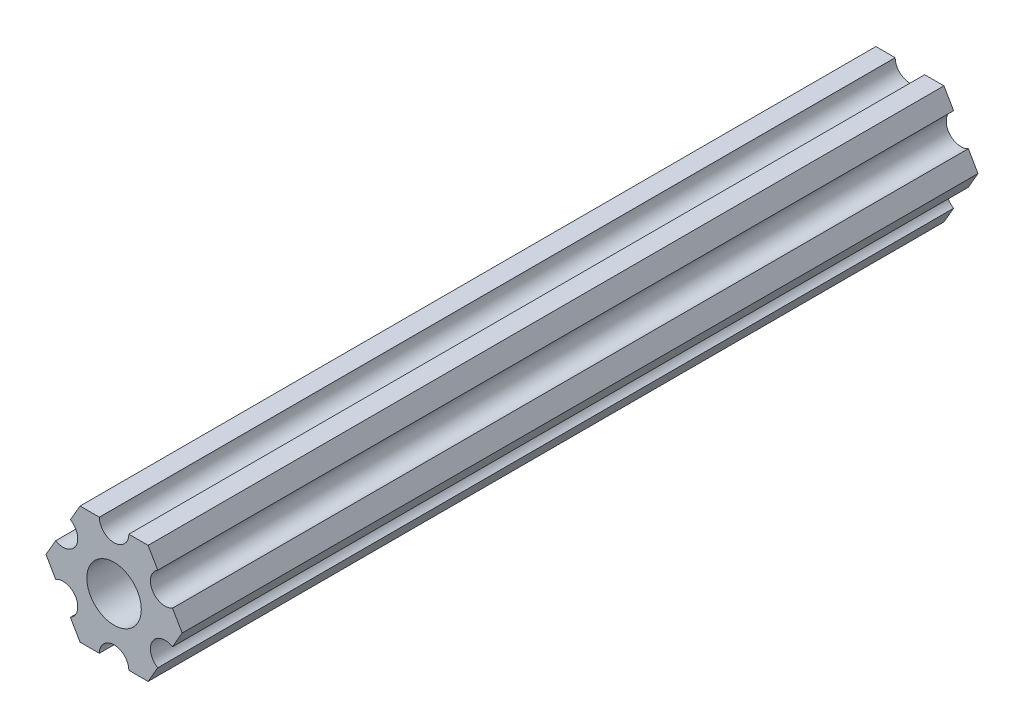
ISO-10303-21;
HEADER;
FILE_DESCRIPTION(('STEP AP214'),'2;1');
FILE_NAME('part.step','',(''),(''),'','','');
FILE_SCHEMA(('AUTOMOTIVE_DESIGN { 1 0 10303 214 1 1 1 1 }'));
ENDSEC;
DATA;
#1=APPLICATION_CONTEXT('core data for automotive mechanical design processes');
#2=APPLICATION_PROTOCOL_DEFINITION('international standard','automotive_design',2000,#1);
#3=PRODUCT_CONTEXT('',#1,'mechanical');
#4=PRODUCT('Part','Part','',(#3));
#5=PRODUCT_RELATED_PRODUCT_CATEGORY('part','',(#4));
#6=PRODUCT_DEFINITION_FORMATION('','',#4);
#7=PRODUCT_DEFINITION_CONTEXT('part definition',#1,'design');
#8=PRODUCT_DEFINITION('design','',#6,#7);
#9=PRODUCT_DEFINITION_SHAPE('','',#8);
#10=(LENGTH_UNIT() NAMED_UNIT(*) SI_UNIT(.MILLI.,.METRE.));
#11=(NAMED_UNIT(*) PLANE_ANGLE_UNIT() SI_UNIT($,.RADIAN.));
#12=(NAMED_UNIT(*) SI_UNIT($,.STERADIAN.) SOLID_ANGLE_UNIT());
#13=UNCERTAINTY_MEASURE_WITH_UNIT(LENGTH_MEASURE(1.E-05),#10,'distance_accuracy_value','');
#14=(GEOMETRIC_REPRESENTATION_CONTEXT(3) GLOBAL_UNCERTAINTY_ASSIGNED_CONTEXT((#13)) GLOBAL_UNIT_ASSIGNED_CONTEXT((#10,
#11,#12)) REPRESENTATION_CONTEXT('',''));
#15=CARTESIAN_POINT('',(0.,0.,0.));
#16=DIRECTION('',(0.,0.,1.));
#17=DIRECTION('',(1.,0.,0.));
#18=AXIS2_PLACEMENT_3D('',#15,#16,#17);
#19=CARTESIAN_POINT('',(5.49926112168156,3.17500033315933,85.725));
#20=DIRECTION('',(0.,0.,1.));
#21=DIRECTION('',(1.,0.,0.));
#22=AXIS2_PLACEMENT_3D('',#19,#20,#21);
#23=PLANE('',#22);
#24=DIRECTION('',(0.499999947533953,0.866025434075723,0.));
#25=VECTOR('',#24,1.);
#26=CARTESIAN_POINT('',(6.29301142309098,-1.80018429024546,85.725));
#27=LINE('',#26,#25);
#28=CARTESIAN_POINT('',(6.29301142309098,-1.80018429024546,85.725));
#29=VERTEX_POINT('',#28);
#30=CARTESIAN_POINT('',(7.33234841870826,4.44212519169686E-07,85.725));
#31=VERTEX_POINT('',#30);
#32=EDGE_CURVE('E228',#29,#31,#27,.T.);
#33=ORIENTED_EDGE('',*,*,#32,.T.);
#34=DIRECTION('',(-0.500000052466056,0.866025373493145,0.));
#35=VECTOR('',#34,1.);
#36=CARTESIAN_POINT('',(7.33234841870826,4.44212519169686E-07,85.725));
#37=LINE('',#36,#35);
#38=CARTESIAN_POINT('',(6.29301120497139,1.80018505273894,85.725));
#39=VERTEX_POINT('',#38);
#40=EDGE_CURVE('E126',#31,#39,#37,.T.);
#41=ORIENTED_EDGE('',*,*,#40,.T.);
#42=CARTESIAN_POINT('',(5.49926112168156,3.17500033315933,85.725));
#43=DIRECTION('',(0.,0.,-1.));
#44=DIRECTION('',(1.,0.,0.));
#45=AXIS2_PLACEMENT_3D('',#42,#43,#44);
#46=CIRCLE('',#45,1.5875);
#47=CARTESIAN_POINT('',(4.70551103839172,4.54981561357972,85.725));
#48=VERTEX_POINT('',#47);
#49=EDGE_CURVE('E273',#39,#48,#46,.T.);
#50=ORIENTED_EDGE('',*,*,#49,.T.);
#51=DIRECTION('',(-0.500000052466046,0.866025373493151,0.));
#52=VECTOR('',#51,1.);
#53=CARTESIAN_POINT('',(4.70551103839172,4.54981561357972,85.725));
#54=LINE('',#53,#52);
#55=CARTESIAN_POINT('',(3.66617382465481,6.35000022210627,85.725));
#56=VERTEX_POINT('',#55);
#57=EDGE_CURVE('E292',#48,#56,#54,.T.);
#58=ORIENTED_EDGE('',*,*,#57,.T.);
#59=DIRECTION('',(-0.999999999999998,-6.05825850611185E-08,0.));
#60=VECTOR('',#59,1.);
#61=CARTESIAN_POINT('',(3.66617382465481,6.35000022210627,85.725));
#62=LINE('',#61,#60);
#63=CARTESIAN_POINT('',(1.58749961530074,6.35000009617482,85.725));
#64=VERTEX_POINT('',#63);
#65=EDGE_CURVE('E289',#56,#64,#62,.T.);
#66=ORIENTED_EDGE('',*,*,#65,.T.);
#67=CARTESIAN_POINT('',(-3.84699260060323E-07,6.35,85.725));
#68=DIRECTION('',(0.,0.,-1.));
#69=DIRECTION('',(1.,0.,0.));
#70=AXIS2_PLACEMENT_3D('',#67,#68,#69);
#71=CIRCLE('',#70,1.5875);
#72=CARTESIAN_POINT('',(-1.58750038469926,6.34999990382518,85.725));
#73=VERTEX_POINT('',#72);
#74=EDGE_CURVE('E291',#64,#73,#71,.T.);
#75=ORIENTED_EDGE('',*,*,#74,.T.);
#76=DIRECTION('',(-0.999999999999998,-6.05825963273174E-08,0.));
#77=VECTOR('',#76,1.);
#78=CARTESIAN_POINT('',(-1.58750038469926,6.34999990382518,85.725));
#79=LINE('',#78,#77);
#80=CARTESIAN_POINT('',(-3.66617459405349,6.3499997778937,85.725));
#81=VERTEX_POINT('',#80);
#82=EDGE_CURVE('E294',#73,#81,#79,.T.);
#83=ORIENTED_EDGE('',*,*,#82,.T.);
#84=DIRECTION('',(-0.499999947533942,-0.866025434075729,0.));
#85=VECTOR('',#84,1.);
#86=CARTESIAN_POINT('',(-3.66617459405349,6.3499997778937,85.725));
#87=LINE('',#86,#85);
#88=CARTESIAN_POINT('',(-4.70551158967065,4.54981504343587,85.725));
#89=VERTEX_POINT('',#88);
#90=EDGE_CURVE('E300',#81,#89,#87,.T.);
#91=ORIENTED_EDGE('',*,*,#90,.T.);
#92=CARTESIAN_POINT('',(-5.49926150638082,3.17499966684067,85.725));
#93=DIRECTION('',(0.,0.,-1.));
#94=DIRECTION('',(1.,0.,0.));
#95=AXIS2_PLACEMENT_3D('',#92,#93,#94);
#96=CIRCLE('',#95,1.5875);
#97=CARTESIAN_POINT('',(-6.29301142309098,1.80018429024547,85.725));
#98=VERTEX_POINT('',#97);
#99=EDGE_CURVE('E302',#89,#98,#96,.T.);
#100=ORIENTED_EDGE('',*,*,#99,.T.);
#101=DIRECTION('',(-0.499999947533951,-0.866025434075724,0.));
#102=VECTOR('',#101,1.);
#103=CARTESIAN_POINT('',(-6.29301142309098,1.80018429024547,85.725));
#104=LINE('',#103,#102);
#105=CARTESIAN_POINT('',(-7.33234841870826,-4.44212523790841E-07,85.725));
#106=VERTEX_POINT('',#105);
#107=EDGE_CURVE('E304',#98,#106,#104,.T.);
#108=ORIENTED_EDGE('',*,*,#107,.T.);
#109=DIRECTION('',(0.500000052466045,-0.866025373493151,0.));
#110=VECTOR('',#109,1.);
#111=CARTESIAN_POINT('',(-7.33234841870826,-4.44212523790841E-07,85.725));
#112=LINE('',#111,#110);
#113=CARTESIAN_POINT('',(-6.29301120497141,-1.80018505273897,85.725));
#114=VERTEX_POINT('',#113);
#115=EDGE_CURVE('E306',#106,#114,#112,.T.);
#116=ORIENTED_EDGE('',*,*,#115,.T.);
#117=CARTESIAN_POINT('',(-5.49926112168156,-3.17500033315934,85.725));
#118=DIRECTION('',(0.,0.,-1.));
#119=DIRECTION('',(1.,0.,0.));
#120=AXIS2_PLACEMENT_3D('',#117,#118,#119);
#121=CIRCLE('',#120,1.5875);
#122=CARTESIAN_POINT('',(-4.70551103839172,-4.54981561357972,85.725));
#123=VERTEX_POINT('',#122);
#124=EDGE_CURVE('E308',#114,#123,#121,.T.);
#125=ORIENTED_EDGE('',*,*,#124,.T.);
#126=DIRECTION('',(0.500000052466045,-0.866025373493151,0.));
#127=VECTOR('',#126,1.);
#128=CARTESIAN_POINT('',(-4.70551103839172,-4.54981561357972,85.725));
#129=LINE('',#128,#127);
#130=CARTESIAN_POINT('',(-3.66617382465481,-6.35000022210628,85.725));
#131=VERTEX_POINT('',#130);
#132=EDGE_CURVE('E310',#123,#131,#129,.T.);
#133=ORIENTED_EDGE('',*,*,#132,.T.);
#134=DIRECTION('',(0.999999999999998,6.05825854783851E-08,0.));
#135=VECTOR('',#134,1.);
#136=CARTESIAN_POINT('',(-3.66617382465481,-6.35000022210628,85.725));
#137=LINE('',#136,#135);
#138=CARTESIAN_POINT('',(-1.58749961530074,-6.35000009617482,85.725));
#139=VERTEX_POINT('',#138);
#140=EDGE_CURVE('E312',#131,#139,#137,.T.);
#141=ORIENTED_EDGE('',*,*,#140,.T.);
#142=CARTESIAN_POINT('',(3.8469926204343E-07,-6.35,85.725));
#143=DIRECTION('',(0.,0.,-1.));
#144=DIRECTION('',(1.,0.,0.));
#145=AXIS2_PLACEMENT_3D('',#142,#143,#144);
#146=CIRCLE('',#145,1.5875);
#147=CARTESIAN_POINT('',(1.58750038469926,-6.34999990382518,85.725));
#148=VERTEX_POINT('',#147);
#149=EDGE_CURVE('E175',#139,#148,#146,.T.);
#150=ORIENTED_EDGE('',*,*,#149,.T.);
#151=DIRECTION('',(0.999999999999998,6.05825721258438E-08,0.));
#152=VECTOR('',#151,1.);
#153=CARTESIAN_POINT('',(1.58750038469926,-6.34999990382518,85.725));
#154=LINE('',#153,#152);
#155=CARTESIAN_POINT('',(3.66617459405346,-6.34999977789375,85.725));
#156=VERTEX_POINT('',#155);
#157=EDGE_CURVE('E169',#148,#156,#154,.T.);
#158=ORIENTED_EDGE('',*,*,#157,.T.);
#159=DIRECTION('',(0.499999947533941,0.86602543407573,0.));
#160=VECTOR('',#159,1.);
#161=CARTESIAN_POINT('',(3.66617459405346,-6.34999977789375,85.725));
#162=LINE('',#161,#160);
#163=CARTESIAN_POINT('',(4.70551158967065,-4.54981504343587,85.725));
#164=VERTEX_POINT('',#163);
#165=EDGE_CURVE('E173',#156,#164,#162,.T.);
#166=ORIENTED_EDGE('',*,*,#165,.T.);
#167=CARTESIAN_POINT('',(5.49926150638082,-3.17499966684067,85.725));
#168=DIRECTION('',(0.,0.,-1.));
#169=DIRECTION('',(1.,0.,0.));
#170=AXIS2_PLACEMENT_3D('',#167,#168,#169);
#171=CIRCLE('',#170,1.58750000000001);
#172=EDGE_CURVE('E53',#164,#29,#171,.T.);
#173=ORIENTED_EDGE('',*,*,#172,.T.);
#174=EDGE_LOOP('',(#33,#41,#50,#58,#66,#75,#83,#91,#100,#108,#116,#125,#133,#141,#150,#158,#166,#173));
#175=FACE_BOUND('',#174,.T.);
#176=CARTESIAN_POINT('',(0.,0.,85.725));
#177=DIRECTION('',(0.,0.,1.));
#178=DIRECTION('',(1.,0.,0.));
#179=AXIS2_PLACEMENT_3D('',#176,#177,#178);
#180=CIRCLE('',#179,2.9337);
#181=CARTESIAN_POINT('',(2.9337,0.,85.725));
#182=VERTEX_POINT('',#181);
#183=EDGE_CURVE('E197',#182,#182,#180,.T.);
#184=ORIENTED_EDGE('',*,*,#183,.F.);
#185=EDGE_LOOP('',(#184));
#186=FACE_BOUND('',#185,.T.);
#187=ADVANCED_FACE('F36',(#175,#186),#23,.T.);
#188=CARTESIAN_POINT('',(5.49926112168156,3.17500033315933,0.));
#189=DIRECTION('',(0.,0.,1.));
#190=DIRECTION('',(1.,0.,0.));
#191=AXIS2_PLACEMENT_3D('',#188,#189,#190);
#192=PLANE('',#191);
#193=DIRECTION('',(0.499999947533953,0.866025434075723,0.));
#194=VECTOR('',#193,1.);
#195=CARTESIAN_POINT('',(6.29301142309098,-1.80018429024546,0.));
#196=LINE('',#195,#194);
#197=CARTESIAN_POINT('',(6.29301142309098,-1.80018429024546,0.));
#198=VERTEX_POINT('',#197);
#199=CARTESIAN_POINT('',(7.33234841870826,4.44212519169686E-07,0.));
#200=VERTEX_POINT('',#199);
#201=EDGE_CURVE('E193',#198,#200,#196,.T.);
#202=ORIENTED_EDGE('',*,*,#201,.F.);
#203=CARTESIAN_POINT('',(5.49926150638082,-3.17499966684067,0.));
#204=DIRECTION('',(0.,0.,-1.));
#205=DIRECTION('',(1.,0.,0.));
#206=AXIS2_PLACEMENT_3D('',#203,#204,#205);
#207=CIRCLE('',#206,1.58750000000001);
#208=CARTESIAN_POINT('',(4.70551158967065,-4.54981504343587,0.));
#209=VERTEX_POINT('',#208);
#210=EDGE_CURVE('E118',#209,#198,#207,.T.);
#211=ORIENTED_EDGE('',*,*,#210,.F.);
#212=DIRECTION('',(0.499999947533941,0.86602543407573,0.));
#213=VECTOR('',#212,1.);
#214=CARTESIAN_POINT('',(3.66617459405346,-6.34999977789375,0.));
#215=LINE('',#214,#213);
#216=CARTESIAN_POINT('',(3.66617459405346,-6.34999977789375,0.));
#217=VERTEX_POINT('',#216);
#218=EDGE_CURVE('E112',#217,#209,#215,.T.);
#219=ORIENTED_EDGE('',*,*,#218,.F.);
#220=DIRECTION('',(0.999999999999998,6.05825721258438E-08,0.));
#221=VECTOR('',#220,1.);
#222=CARTESIAN_POINT('',(1.58750038469926,-6.34999990382518,0.));
#223=LINE('',#222,#221);
#224=CARTESIAN_POINT('',(1.58750038469926,-6.34999990382518,0.));
#225=VERTEX_POINT('',#224);
#226=EDGE_CURVE('E183',#225,#217,#223,.T.);
#227=ORIENTED_EDGE('',*,*,#226,.F.);
#228=CARTESIAN_POINT('',(3.8469926204343E-07,-6.35,0.));
#229=DIRECTION('',(0.,0.,-1.));
#230=DIRECTION('',(1.,0.,0.));
#231=AXIS2_PLACEMENT_3D('',#228,#229,#230);
#232=CIRCLE('',#231,1.5875);
#233=CARTESIAN_POINT('',(-1.58749961530074,-6.35000009617482,0.));
#234=VERTEX_POINT('',#233);
#235=EDGE_CURVE('E223',#234,#225,#232,.T.);
#236=ORIENTED_EDGE('',*,*,#235,.F.);
#237=DIRECTION('',(0.999999999999998,6.05825854783851E-08,0.));
#238=VECTOR('',#237,1.);
#239=CARTESIAN_POINT('',(-3.66617382465481,-6.35000022210628,0.));
#240=LINE('',#239,#238);
#241=CARTESIAN_POINT('',(-3.66617382465481,-6.35000022210628,0.));
#242=VERTEX_POINT('',#241);
#243=EDGE_CURVE('E221',#242,#234,#240,.T.);
#244=ORIENTED_EDGE('',*,*,#243,.F.);
#245=DIRECTION('',(0.500000052466045,-0.866025373493151,0.));
#246=VECTOR('',#245,1.);
#247=CARTESIAN_POINT('',(-4.70551103839172,-4.54981561357972,0.));
#248=LINE('',#247,#246);
#249=CARTESIAN_POINT('',(-4.70551103839172,-4.54981561357972,0.));
#250=VERTEX_POINT('',#249);
#251=EDGE_CURVE('E219',#250,#242,#248,.T.);
#252=ORIENTED_EDGE('',*,*,#251,.F.);
#253=CARTESIAN_POINT('',(-5.49926112168156,-3.17500033315934,0.));
#254=DIRECTION('',(0.,0.,-1.));
#255=DIRECTION('',(1.,0.,0.));
#256=AXIS2_PLACEMENT_3D('',#253,#254,#255);
#257=CIRCLE('',#256,1.5875);
#258=CARTESIAN_POINT('',(-6.29301120497141,-1.80018505273897,0.));
#259=VERTEX_POINT('',#258);
#260=EDGE_CURVE('E217',#259,#250,#257,.T.);
#261=ORIENTED_EDGE('',*,*,#260,.F.);
#262=DIRECTION('',(0.500000052466045,-0.866025373493151,0.));
#263=VECTOR('',#262,1.);
#264=CARTESIAN_POINT('',(-7.33234841870826,-4.44212523790841E-07,0.));
#265=LINE('',#264,#263);
#266=CARTESIAN_POINT('',(-7.33234841870826,-4.44212523790841E-07,0.));
#267=VERTEX_POINT('',#266);
#268=EDGE_CURVE('E215',#267,#259,#265,.T.);
#269=ORIENTED_EDGE('',*,*,#268,.F.);
#270=DIRECTION('',(-0.499999947533951,-0.866025434075724,0.));
#271=VECTOR('',#270,1.);
#272=CARTESIAN_POINT('',(-6.29301142309098,1.80018429024547,0.));
#273=LINE('',#272,#271);
#274=CARTESIAN_POINT('',(-6.29301142309098,1.80018429024547,0.));
#275=VERTEX_POINT('',#274);
#276=EDGE_CURVE('E213',#275,#267,#273,.T.);
#277=ORIENTED_EDGE('',*,*,#276,.F.);
#278=CARTESIAN_POINT('',(-5.49926150638082,3.17499966684067,0.));
#279=DIRECTION('',(0.,0.,-1.));
#280=DIRECTION('',(1.,0.,0.));
#281=AXIS2_PLACEMENT_3D('',#278,#279,#280);
#282=CIRCLE('',#281,1.5875);
#283=CARTESIAN_POINT('',(-4.70551158967065,4.54981504343587,0.));
#284=VERTEX_POINT('',#283);
#285=EDGE_CURVE('E211',#284,#275,#282,.T.);
#286=ORIENTED_EDGE('',*,*,#285,.F.);
#287=DIRECTION('',(-0.499999947533942,-0.866025434075729,0.));
#288=VECTOR('',#287,1.);
#289=CARTESIAN_POINT('',(-3.66617459405349,6.3499997778937,0.));
#290=LINE('',#289,#288);
#291=CARTESIAN_POINT('',(-3.66617459405349,6.3499997778937,0.));
#292=VERTEX_POINT('',#291);
#293=EDGE_CURVE('E209',#292,#284,#290,.T.);
#294=ORIENTED_EDGE('',*,*,#293,.F.);
#295=DIRECTION('',(-0.999999999999998,-6.05825963273174E-08,0.));
#296=VECTOR('',#295,1.);
#297=CARTESIAN_POINT('',(-1.58750038469926,6.34999990382518,0.));
#298=LINE('',#297,#296);
#299=CARTESIAN_POINT('',(-1.58750038469926,6.34999990382518,0.));
#300=VERTEX_POINT('',#299);
#301=EDGE_CURVE('E207',#300,#292,#298,.T.);
#302=ORIENTED_EDGE('',*,*,#301,.F.);
#303=CARTESIAN_POINT('',(-3.84699260060323E-07,6.35,0.));
#304=DIRECTION('',(0.,0.,-1.));
#305=DIRECTION('',(1.,0.,0.));
#306=AXIS2_PLACEMENT_3D('',#303,#304,#305);
#307=CIRCLE('',#306,1.5875);
#308=CARTESIAN_POINT('',(1.58749961530074,6.35000009617482,0.));
#309=VERTEX_POINT('',#308);
#310=EDGE_CURVE('E205',#309,#300,#307,.T.);
#311=ORIENTED_EDGE('',*,*,#310,.F.);
#312=DIRECTION('',(-0.999999999999998,-6.05825850611185E-08,0.));
#313=VECTOR('',#312,1.);
#314=CARTESIAN_POINT('',(3.66617382465481,6.35000022210627,0.));
#315=LINE('',#314,#313);
#316=CARTESIAN_POINT('',(3.66617382465481,6.35000022210627,0.));
#317=VERTEX_POINT('',#316);
#318=EDGE_CURVE('E203',#317,#309,#315,.T.);
#319=ORIENTED_EDGE('',*,*,#318,.F.);
#320=DIRECTION('',(-0.500000052466046,0.866025373493151,0.));
#321=VECTOR('',#320,1.);
#322=CARTESIAN_POINT('',(4.70551103839172,4.54981561357972,0.));
#323=LINE('',#322,#321);
#324=CARTESIAN_POINT('',(4.70551103839172,4.54981561357972,0.));
#325=VERTEX_POINT('',#324);
#326=EDGE_CURVE('E201',#325,#317,#323,.T.);
#327=ORIENTED_EDGE('',*,*,#326,.F.);
#328=CARTESIAN_POINT('',(5.49926112168156,3.17500033315933,0.));
#329=DIRECTION('',(0.,0.,-1.));
#330=DIRECTION('',(1.,0.,0.));
#331=AXIS2_PLACEMENT_3D('',#328,#329,#330);
#332=CIRCLE('',#331,1.5875);
#333=CARTESIAN_POINT('',(6.29301120497139,1.80018505273894,0.));
#334=VERTEX_POINT('',#333);
#335=EDGE_CURVE('E199',#334,#325,#332,.T.);
#336=ORIENTED_EDGE('',*,*,#335,.F.);
#337=DIRECTION('',(-0.500000052466056,0.866025373493145,0.));
#338=VECTOR('',#337,1.);
#339=CARTESIAN_POINT('',(7.33234841870826,4.44212519169686E-07,0.));
#340=LINE('',#339,#338);
#341=EDGE_CURVE('E196',#200,#334,#340,.T.);
#342=ORIENTED_EDGE('',*,*,#341,.F.);
#343=EDGE_LOOP('',(#202,#211,#219,#227,#236,#244,#252,#261,#269,#277,#286,#294,#302,#311,#319,
#327,#336,#342));
#344=FACE_BOUND('',#343,.T.);
#345=CARTESIAN_POINT('',(0.,0.,0.));
#346=DIRECTION('',(0.,0.,1.));
#347=DIRECTION('',(1.,0.,0.));
#348=AXIS2_PLACEMENT_3D('',#345,#346,#347);
#349=CIRCLE('',#348,2.9337);
#350=CARTESIAN_POINT('',(2.9337,0.,0.));
#351=VERTEX_POINT('',#350);
#352=EDGE_CURVE('E537',#351,#351,#349,.T.);
#353=ORIENTED_EDGE('',*,*,#352,.T.);
#354=EDGE_LOOP('',(#353));
#355=FACE_BOUND('',#354,.T.);
#356=ADVANCED_FACE('F277',(#344,#355),#192,.F.);
#357=CARTESIAN_POINT('',(6.29301142309098,-1.80018429024546,85.725));
#358=DIRECTION('',(-0.866025434075723,0.499999947533953,0.));
#359=DIRECTION('',(-0.499999947533953,-0.866025434075723,0.));
#360=AXIS2_PLACEMENT_3D('',#357,#358,#359);
#361=PLANE('',#360);
#362=ORIENTED_EDGE('',*,*,#201,.T.);
#363=DIRECTION('',(0.,0.,-1.));
#364=VECTOR('',#363,1.);
#365=CARTESIAN_POINT('',(7.33234841870826,4.44212519169686E-07,85.725));
#366=LINE('',#365,#364);
#367=EDGE_CURVE('E11',#31,#200,#366,.T.);
#368=ORIENTED_EDGE('',*,*,#367,.F.);
#369=ORIENTED_EDGE('',*,*,#32,.F.);
#370=DIRECTION('',(0.,0.,-1.));
#371=VECTOR('',#370,1.);
#372=CARTESIAN_POINT('',(6.29301142309098,-1.80018429024546,85.725));
#373=LINE('',#372,#371);
#374=EDGE_CURVE('E189',#29,#198,#373,.T.);
#375=ORIENTED_EDGE('',*,*,#374,.T.);
#376=EDGE_LOOP('',(#362,#368,#369,#375));
#377=FACE_BOUND('',#376,.T.);
#378=ADVANCED_FACE('F38',(#377),#361,.F.);
#379=CARTESIAN_POINT('',(7.33234841870826,4.44212519169686E-07,85.725));
#380=DIRECTION('',(-0.866025373493145,-0.500000052466056,0.));
#381=DIRECTION('',(0.500000052466056,-0.866025373493145,0.));
#382=AXIS2_PLACEMENT_3D('',#379,#380,#381);
#383=PLANE('',#382);
#384=ORIENTED_EDGE('',*,*,#341,.T.);
#385=DIRECTION('',(0.,0.,-1.));
#386=VECTOR('',#385,1.);
#387=CARTESIAN_POINT('',(6.29301120497139,1.80018505273894,85.725));
#388=LINE('',#387,#386);
#389=EDGE_CURVE('E45',#39,#334,#388,.T.);
#390=ORIENTED_EDGE('',*,*,#389,.F.);
#391=ORIENTED_EDGE('',*,*,#40,.F.);
#392=ORIENTED_EDGE('',*,*,#367,.T.);
#393=EDGE_LOOP('',(#384,#390,#391,#392));
#394=FACE_BOUND('',#393,.T.);
#395=ADVANCED_FACE('F346',(#394),#383,.F.);
#396=CARTESIAN_POINT('',(5.49926112168156,3.17500033315933,85.725));
#397=DIRECTION('',(0.,0.,-1.));
#398=DIRECTION('',(-1.,0.,0.));
#399=AXIS2_PLACEMENT_3D('',#396,#397,#398);
#400=CYLINDRICAL_SURFACE('',#399,1.5875);
#401=ORIENTED_EDGE('',*,*,#335,.T.);
#402=DIRECTION('',(0.,0.,-1.));
#403=VECTOR('',#402,1.);
#404=CARTESIAN_POINT('',(4.70551103839172,4.54981561357972,85.725));
#405=LINE('',#404,#403);
#406=EDGE_CURVE('E265',#48,#325,#405,.T.);
#407=ORIENTED_EDGE('',*,*,#406,.F.);
#408=ORIENTED_EDGE('',*,*,#49,.F.);
#409=ORIENTED_EDGE('',*,*,#389,.T.);
#410=EDGE_LOOP('',(#401,#407,#408,#409));
#411=FACE_BOUND('',#410,.T.);
#412=ADVANCED_FACE('F271',(#411),#400,.F.);
#413=CARTESIAN_POINT('',(4.70551103839172,4.54981561357972,85.725));
#414=DIRECTION('',(-0.866025373493151,-0.500000052466046,0.));
#415=DIRECTION('',(0.500000052466046,-0.866025373493151,0.));
#416=AXIS2_PLACEMENT_3D('',#413,#414,#415);
#417=PLANE('',#416);
#418=ORIENTED_EDGE('',*,*,#326,.T.);
#419=DIRECTION('',(0.,0.,-1.));
#420=VECTOR('',#419,1.);
#421=CARTESIAN_POINT('',(3.66617382465481,6.35000022210627,85.725));
#422=LINE('',#421,#420);
#423=EDGE_CURVE('E262',#56,#317,#422,.T.);
#424=ORIENTED_EDGE('',*,*,#423,.F.);
#425=ORIENTED_EDGE('',*,*,#57,.F.);
#426=ORIENTED_EDGE('',*,*,#406,.T.);
#427=EDGE_LOOP('',(#418,#424,#425,#426));
#428=FACE_BOUND('',#427,.T.);
#429=ADVANCED_FACE('F283',(#428),#417,.F.);
#430=CARTESIAN_POINT('',(3.66617382465481,6.35000022210627,85.725));
#431=DIRECTION('',(6.05825850611185E-08,-0.999999999999998,0.));
#432=DIRECTION('',(0.999999999999998,6.05825850611185E-08,0.));
#433=AXIS2_PLACEMENT_3D('',#430,#431,#432);
#434=PLANE('',#433);
#435=ORIENTED_EDGE('',*,*,#318,.T.);
#436=DIRECTION('',(0.,0.,-1.));
#437=VECTOR('',#436,1.);
#438=CARTESIAN_POINT('',(1.58749961530074,6.35000009617482,85.725));
#439=LINE('',#438,#437);
#440=EDGE_CURVE('E259',#64,#309,#439,.T.);
#441=ORIENTED_EDGE('',*,*,#440,.F.);
#442=ORIENTED_EDGE('',*,*,#65,.F.);
#443=ORIENTED_EDGE('',*,*,#423,.T.);
#444=EDGE_LOOP('',(#435,#441,#442,#443));
#445=FACE_BOUND('',#444,.T.);
#446=ADVANCED_FACE('F287',(#445),#434,.F.);
#447=CARTESIAN_POINT('',(-3.84699260060323E-07,6.35,85.725));
#448=DIRECTION('',(0.,0.,-1.));
#449=DIRECTION('',(-1.,0.,0.));
#450=AXIS2_PLACEMENT_3D('',#447,#448,#449);
#451=CYLINDRICAL_SURFACE('',#450,1.5875);
#452=ORIENTED_EDGE('',*,*,#310,.T.);
#453=DIRECTION('',(0.,0.,-1.));
#454=VECTOR('',#453,1.);
#455=CARTESIAN_POINT('',(-1.58750038469926,6.34999990382518,85.725));
#456=LINE('',#455,#454);
#457=EDGE_CURVE('E256',#73,#300,#456,.T.);
#458=ORIENTED_EDGE('',*,*,#457,.F.);
#459=ORIENTED_EDGE('',*,*,#74,.F.);
#460=ORIENTED_EDGE('',*,*,#440,.T.);
#461=EDGE_LOOP('',(#452,#458,#459,#460));
#462=FACE_BOUND('',#461,.T.);
#463=ADVANCED_FACE('F359',(#462),#451,.F.);
#464=CARTESIAN_POINT('',(-1.58750038469926,6.34999990382518,85.725));
#465=DIRECTION('',(6.05825963273174E-08,-0.999999999999998,0.));
#466=DIRECTION('',(0.999999999999998,6.05825963273174E-08,0.));
#467=AXIS2_PLACEMENT_3D('',#464,#465,#466);
#468=PLANE('',#467);
#469=ORIENTED_EDGE('',*,*,#301,.T.);
#470=DIRECTION('',(0.,0.,-1.));
#471=VECTOR('',#470,1.);
#472=CARTESIAN_POINT('',(-3.66617459405349,6.3499997778937,85.725));
#473=LINE('',#472,#471);
#474=EDGE_CURVE('E253',#81,#292,#473,.T.);
#475=ORIENTED_EDGE('',*,*,#474,.F.);
#476=ORIENTED_EDGE('',*,*,#82,.F.);
#477=ORIENTED_EDGE('',*,*,#457,.T.);
#478=EDGE_LOOP('',(#469,#475,#476,#477));
#479=FACE_BOUND('',#478,.T.);
#480=ADVANCED_FACE('F362',(#479),#468,.F.);
#481=CARTESIAN_POINT('',(-3.66617459405349,6.3499997778937,85.725));
#482=DIRECTION('',(0.866025434075729,-0.499999947533942,0.));
#483=DIRECTION('',(0.499999947533942,0.866025434075729,0.));
#484=AXIS2_PLACEMENT_3D('',#481,#482,#483);
#485=PLANE('',#484);
#486=ORIENTED_EDGE('',*,*,#293,.T.);
#487=DIRECTION('',(0.,0.,-1.));
#488=VECTOR('',#487,1.);
#489=CARTESIAN_POINT('',(-4.70551158967065,4.54981504343587,85.725));
#490=LINE('',#489,#488);
#491=EDGE_CURVE('E250',#89,#284,#490,.T.);
#492=ORIENTED_EDGE('',*,*,#491,.F.);
#493=ORIENTED_EDGE('',*,*,#90,.F.);
#494=ORIENTED_EDGE('',*,*,#474,.T.);
#495=EDGE_LOOP('',(#486,#492,#493,#494));
#496=FACE_BOUND('',#495,.T.);
#497=ADVANCED_FACE('F366',(#496),#485,.F.);
#498=CARTESIAN_POINT('',(-5.49926150638082,3.17499966684067,85.725));
#499=DIRECTION('',(0.,0.,-1.));
#500=DIRECTION('',(-1.,0.,0.));
#501=AXIS2_PLACEMENT_3D('',#498,#499,#500);
#502=CYLINDRICAL_SURFACE('',#501,1.5875);
#503=ORIENTED_EDGE('',*,*,#285,.T.);
#504=DIRECTION('',(0.,0.,-1.));
#505=VECTOR('',#504,1.);
#506=CARTESIAN_POINT('',(-6.29301142309098,1.80018429024547,85.725));
#507=LINE('',#506,#505);
#508=EDGE_CURVE('E247',#98,#275,#507,.T.);
#509=ORIENTED_EDGE('',*,*,#508,.F.);
#510=ORIENTED_EDGE('',*,*,#99,.F.);
#511=ORIENTED_EDGE('',*,*,#491,.T.);
#512=EDGE_LOOP('',(#503,#509,#510,#511));
#513=FACE_BOUND('',#512,.T.);
#514=ADVANCED_FACE('F370',(#513),#502,.F.);
#515=CARTESIAN_POINT('',(-6.29301142309098,1.80018429024547,85.725));
#516=DIRECTION('',(0.866025434075724,-0.499999947533951,0.));
#517=DIRECTION('',(0.499999947533951,0.866025434075724,0.));
#518=AXIS2_PLACEMENT_3D('',#515,#516,#517);
#519=PLANE('',#518);
#520=ORIENTED_EDGE('',*,*,#276,.T.);
#521=DIRECTION('',(0.,0.,-1.));
#522=VECTOR('',#521,1.);
#523=CARTESIAN_POINT('',(-7.33234841870826,-4.44212523790841E-07,85.725));
#524=LINE('',#523,#522);
#525=EDGE_CURVE('E244',#106,#267,#524,.T.);
#526=ORIENTED_EDGE('',*,*,#525,.F.);
#527=ORIENTED_EDGE('',*,*,#107,.F.);
#528=ORIENTED_EDGE('',*,*,#508,.T.);
#529=EDGE_LOOP('',(#520,#526,#527,#528));
#530=FACE_BOUND('',#529,.T.);
#531=ADVANCED_FACE('F374',(#530),#519,.F.);
#532=CARTESIAN_POINT('',(-7.33234841870826,-4.44212523790841E-07,85.725));
#533=DIRECTION('',(0.866025373493151,0.500000052466045,0.));
#534=DIRECTION('',(-0.500000052466045,0.866025373493151,0.));
#535=AXIS2_PLACEMENT_3D('',#532,#533,#534);
#536=PLANE('',#535);
#537=ORIENTED_EDGE('',*,*,#268,.T.);
#538=DIRECTION('',(0.,0.,-1.));
#539=VECTOR('',#538,1.);
#540=CARTESIAN_POINT('',(-6.29301120497141,-1.80018505273897,85.725));
#541=LINE('',#540,#539);
#542=EDGE_CURVE('E241',#114,#259,#541,.T.);
#543=ORIENTED_EDGE('',*,*,#542,.F.);
#544=ORIENTED_EDGE('',*,*,#115,.F.);
#545=ORIENTED_EDGE('',*,*,#525,.T.);
#546=EDGE_LOOP('',(#537,#543,#544,#545));
#547=FACE_BOUND('',#546,.T.);
#548=ADVANCED_FACE('F378',(#547),#536,.F.);
#549=CARTESIAN_POINT('',(-5.49926112168156,-3.17500033315934,85.725));
#550=DIRECTION('',(0.,0.,-1.));
#551=DIRECTION('',(-1.,0.,0.));
#552=AXIS2_PLACEMENT_3D('',#549,#550,#551);
#553=CYLINDRICAL_SURFACE('',#552,1.5875);
#554=ORIENTED_EDGE('',*,*,#260,.T.);
#555=DIRECTION('',(0.,0.,-1.));
#556=VECTOR('',#555,1.);
#557=CARTESIAN_POINT('',(-4.70551103839172,-4.54981561357972,85.725));
#558=LINE('',#557,#556);
#559=EDGE_CURVE('E238',#123,#250,#558,.T.);
#560=ORIENTED_EDGE('',*,*,#559,.F.);
#561=ORIENTED_EDGE('',*,*,#124,.F.);
#562=ORIENTED_EDGE('',*,*,#542,.T.);
#563=EDGE_LOOP('',(#554,#560,#561,#562));
#564=FACE_BOUND('',#563,.T.);
#565=ADVANCED_FACE('F382',(#564),#553,.F.);
#566=CARTESIAN_POINT('',(-4.70551103839172,-4.54981561357972,85.725));
#567=DIRECTION('',(0.866025373493151,0.500000052466045,0.));
#568=DIRECTION('',(-0.500000052466045,0.866025373493151,0.));
#569=AXIS2_PLACEMENT_3D('',#566,#567,#568);
#570=PLANE('',#569);
#571=ORIENTED_EDGE('',*,*,#251,.T.);
#572=DIRECTION('',(0.,0.,-1.));
#573=VECTOR('',#572,1.);
#574=CARTESIAN_POINT('',(-3.66617382465481,-6.35000022210628,85.725));
#575=LINE('',#574,#573);
#576=EDGE_CURVE('E235',#131,#242,#575,.T.);
#577=ORIENTED_EDGE('',*,*,#576,.F.);
#578=ORIENTED_EDGE('',*,*,#132,.F.);
#579=ORIENTED_EDGE('',*,*,#559,.T.);
#580=EDGE_LOOP('',(#571,#577,#578,#579));
#581=FACE_BOUND('',#580,.T.);
#582=ADVANCED_FACE('F386',(#581),#570,.F.);
#583=CARTESIAN_POINT('',(-3.66617382465481,-6.35000022210628,85.725));
#584=DIRECTION('',(-6.05825854783851E-08,0.999999999999998,0.));
#585=DIRECTION('',(-0.999999999999998,-6.05825854783851E-08,0.));
#586=AXIS2_PLACEMENT_3D('',#583,#584,#585);
#587=PLANE('',#586);
#588=ORIENTED_EDGE('',*,*,#243,.T.);
#589=DIRECTION('',(0.,0.,-1.));
#590=VECTOR('',#589,1.);
#591=CARTESIAN_POINT('',(-1.58749961530074,-6.35000009617482,85.725));
#592=LINE('',#591,#590);
#593=EDGE_CURVE('E232',#139,#234,#592,.T.);
#594=ORIENTED_EDGE('',*,*,#593,.F.);
#595=ORIENTED_EDGE('',*,*,#140,.F.);
#596=ORIENTED_EDGE('',*,*,#576,.T.);
#597=EDGE_LOOP('',(#588,#594,#595,#596));
#598=FACE_BOUND('',#597,.T.);
#599=ADVANCED_FACE('F318',(#598),#587,.F.);
#600=CARTESIAN_POINT('',(3.8469926204343E-07,-6.35,85.725));
#601=DIRECTION('',(0.,0.,-1.));
#602=DIRECTION('',(-1.,0.,0.));
#603=AXIS2_PLACEMENT_3D('',#600,#601,#602);
#604=CYLINDRICAL_SURFACE('',#603,1.5875);
#605=ORIENTED_EDGE('',*,*,#235,.T.);
#606=DIRECTION('',(0.,0.,-1.));
#607=VECTOR('',#606,1.);
#608=CARTESIAN_POINT('',(1.58750038469926,-6.34999990382518,85.725));
#609=LINE('',#608,#607);
#610=EDGE_CURVE('E184',#148,#225,#609,.T.);
#611=ORIENTED_EDGE('',*,*,#610,.F.);
#612=ORIENTED_EDGE('',*,*,#149,.F.);
#613=ORIENTED_EDGE('',*,*,#593,.T.);
#614=EDGE_LOOP('',(#605,#611,#612,#613));
#615=FACE_BOUND('',#614,.T.);
#616=ADVANCED_FACE('F322',(#615),#604,.F.);
#617=CARTESIAN_POINT('',(1.58750038469926,-6.34999990382518,85.725));
#618=DIRECTION('',(-6.05825721258438E-08,0.999999999999998,0.));
#619=DIRECTION('',(-0.999999999999998,-6.05825721258438E-08,0.));
#620=AXIS2_PLACEMENT_3D('',#617,#618,#619);
#621=PLANE('',#620);
#622=ORIENTED_EDGE('',*,*,#226,.T.);
#623=DIRECTION('',(0.,0.,-1.));
#624=VECTOR('',#623,1.);
#625=CARTESIAN_POINT('',(3.66617459405346,-6.34999977789375,85.725));
#626=LINE('',#625,#624);
#627=EDGE_CURVE('E180',#156,#217,#626,.T.);
#628=ORIENTED_EDGE('',*,*,#627,.F.);
#629=ORIENTED_EDGE('',*,*,#157,.F.);
#630=ORIENTED_EDGE('',*,*,#610,.T.);
#631=EDGE_LOOP('',(#622,#628,#629,#630));
#632=FACE_BOUND('',#631,.T.);
#633=ADVANCED_FACE('F181',(#632),#621,.F.);
#634=CARTESIAN_POINT('',(3.66617459405346,-6.34999977789375,85.725));
#635=DIRECTION('',(-0.86602543407573,0.499999947533941,0.));
#636=DIRECTION('',(-0.499999947533941,-0.86602543407573,0.));
#637=AXIS2_PLACEMENT_3D('',#634,#635,#636);
#638=PLANE('',#637);
#639=ORIENTED_EDGE('',*,*,#218,.T.);
#640=DIRECTION('',(0.,0.,-1.));
#641=VECTOR('',#640,1.);
#642=CARTESIAN_POINT('',(4.70551158967065,-4.54981504343587,85.725));
#643=LINE('',#642,#641);
#644=EDGE_CURVE('E185',#164,#209,#643,.T.);
#645=ORIENTED_EDGE('',*,*,#644,.F.);
#646=ORIENTED_EDGE('',*,*,#165,.F.);
#647=ORIENTED_EDGE('',*,*,#627,.T.);
#648=EDGE_LOOP('',(#639,#645,#646,#647));
#649=FACE_BOUND('',#648,.T.);
#650=ADVANCED_FACE('F187',(#649),#638,.F.);
#651=CARTESIAN_POINT('',(5.49926150638082,-3.17499966684067,85.725));
#652=DIRECTION('',(0.,0.,-1.));
#653=DIRECTION('',(-1.,0.,0.));
#654=AXIS2_PLACEMENT_3D('',#651,#652,#653);
#655=CYLINDRICAL_SURFACE('',#654,1.58750000000001);
#656=ORIENTED_EDGE('',*,*,#210,.T.);
#657=ORIENTED_EDGE('',*,*,#374,.F.);
#658=ORIENTED_EDGE('',*,*,#172,.F.);
#659=ORIENTED_EDGE('',*,*,#644,.T.);
#660=EDGE_LOOP('',(#656,#657,#658,#659));
#661=FACE_BOUND('',#660,.T.);
#662=ADVANCED_FACE('F326',(#661),#655,.F.);
#663=CARTESIAN_POINT('',(0.,0.,85.725));
#664=DIRECTION('',(0.,0.,-1.));
#665=DIRECTION('',(-1.,0.,0.));
#666=AXIS2_PLACEMENT_3D('',#663,#664,#665);
#667=CYLINDRICAL_SURFACE('',#666,2.9337);
#668=ORIENTED_EDGE('',*,*,#183,.T.);
#669=EDGE_LOOP('',(#668));
#670=FACE_BOUND('',#669,.T.);
#671=ORIENTED_EDGE('',*,*,#352,.F.);
#672=EDGE_LOOP('',(#671));
#673=FACE_BOUND('',#672,.T.);
#674=ADVANCED_FACE('F328',(#670,#673),#667,.F.);
#675=CLOSED_SHELL('',(#187,#356,#378,#395,#412,#429,#446,#463,#480,#497,#514,#531,#548,#565,
#582,#599,#616,#633,#650,#662,#674));
#676=MANIFOLD_SOLID_BREP('B2',#675);
#677=ADVANCED_BREP_SHAPE_REPRESENTATION('',(#18,#676),#14);
#678=SHAPE_DEFINITION_REPRESENTATION(#9,#677);
ENDSEC;
END-ISO-10303-21;
